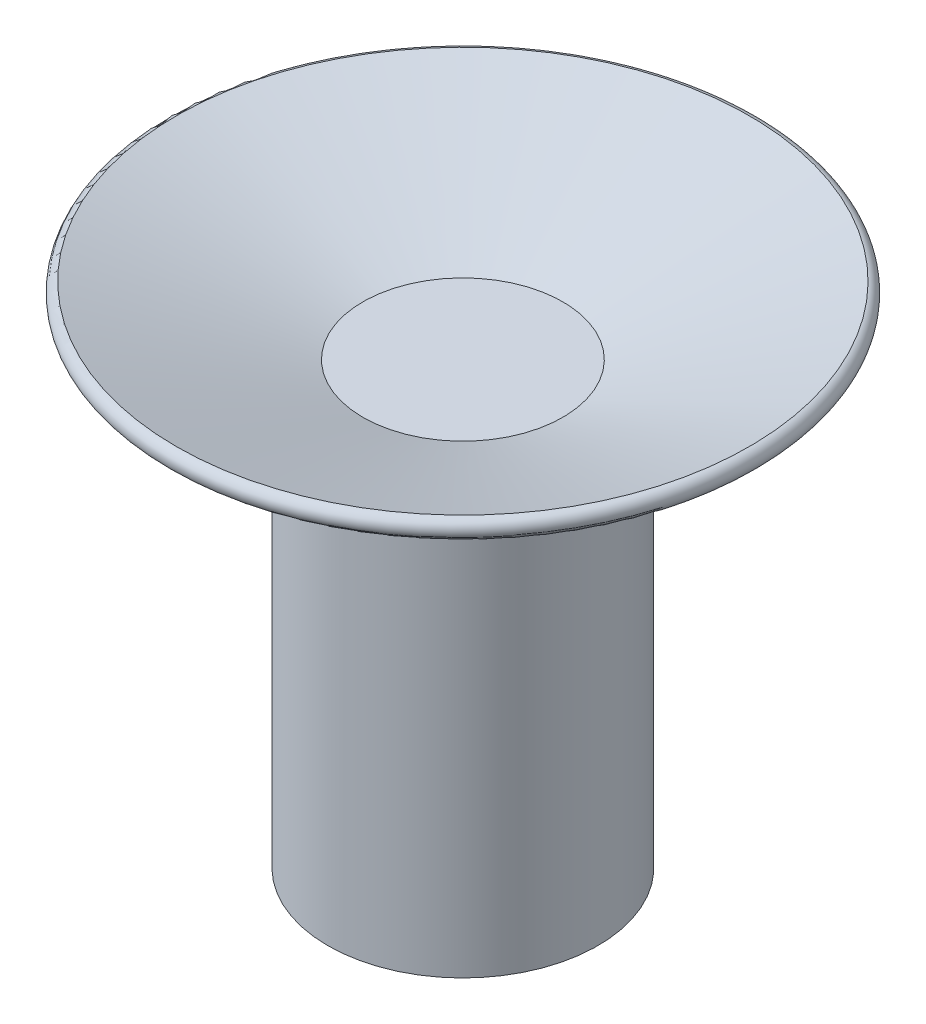
ISO-10303-21;
HEADER;
FILE_DESCRIPTION(('STEP AP214'),'2;1');
FILE_NAME('part.step','',(''),(''),'','','');
FILE_SCHEMA(('AUTOMOTIVE_DESIGN { 1 0 10303 214 1 1 1 1 }'));
ENDSEC;
DATA;
#1=APPLICATION_CONTEXT('core data for automotive mechanical design processes');
#2=APPLICATION_PROTOCOL_DEFINITION('international standard','automotive_design',2000,#1);
#3=PRODUCT_CONTEXT('',#1,'mechanical');
#4=PRODUCT('Part','Part','',(#3));
#5=PRODUCT_RELATED_PRODUCT_CATEGORY('part','',(#4));
#6=PRODUCT_DEFINITION_FORMATION('','',#4);
#7=PRODUCT_DEFINITION_CONTEXT('part definition',#1,'design');
#8=PRODUCT_DEFINITION('design','',#6,#7);
#9=PRODUCT_DEFINITION_SHAPE('','',#8);
#10=(LENGTH_UNIT() NAMED_UNIT(*) SI_UNIT(.MILLI.,.METRE.));
#11=(NAMED_UNIT(*) PLANE_ANGLE_UNIT() SI_UNIT($,.RADIAN.));
#12=(NAMED_UNIT(*) SI_UNIT($,.STERADIAN.) SOLID_ANGLE_UNIT());
#13=UNCERTAINTY_MEASURE_WITH_UNIT(LENGTH_MEASURE(1.E-05),#10,'distance_accuracy_value','');
#14=(GEOMETRIC_REPRESENTATION_CONTEXT(3) GLOBAL_UNCERTAINTY_ASSIGNED_CONTEXT((#13)) GLOBAL_UNIT_ASSIGNED_CONTEXT((#10,
#11,#12)) REPRESENTATION_CONTEXT('',''));
#15=CARTESIAN_POINT('',(0.,0.,0.));
#16=DIRECTION('',(0.,0.,1.));
#17=DIRECTION('',(1.,0.,0.));
#18=AXIS2_PLACEMENT_3D('',#15,#16,#17);
#19=CARTESIAN_POINT('',(0.,0.,0.));
#20=DIRECTION('',(0.,-1.,0.));
#21=DIRECTION('',(0.,0.,1.));
#22=AXIS2_PLACEMENT_3D('',#19,#20,#21);
#23=PLANE('',#22);
#24=DIRECTION('',(0.997623228537443,0.,-0.0689049626843327));
#25=VECTOR('',#24,1.);
#26=CARTESIAN_POINT('',(-2.19569083068635,0.,4.4920977033052));
#27=LINE('',#26,#25);
#28=CARTESIAN_POINT('',(-2.19569083068635,0.,4.49209770330521));
#29=VERTEX_POINT('',#28);
#30=CARTESIAN_POINT('',(2.79242531200086,0.,4.14757288988354));
#31=VERTEX_POINT('',#30);
#32=EDGE_CURVE('E107',#29,#31,#27,.T.);
#33=ORIENTED_EDGE('',*,*,#32,.T.);
#34=CARTESIAN_POINT('',(0.,0.,0.));
#35=DIRECTION('',(0.,1.,0.));
#36=DIRECTION('',(0.,0.,1.));
#37=AXIS2_PLACEMENT_3D('',#34,#35,#36);
#38=CIRCLE('',#37,5.);
#39=EDGE_CURVE('E44',#29,#31,#38,.T.);
#40=ORIENTED_EDGE('',*,*,#39,.F.);
#41=EDGE_LOOP('',(#33,#40));
#42=FACE_BOUND('',#41,.T.);
#43=ADVANCED_FACE('F35',(#42),#23,.T.);
#44=DIRECTION('',(0.558485062400172,0.,0.829514577976708));
#45=VECTOR('',#44,1.);
#46=CARTESIAN_POINT('',(-4.98811614268721,0.,0.344524813421662));
#47=LINE('',#46,#45);
#48=CARTESIAN_POINT('',(-4.98811614268721,0.,0.344524813421667));
#49=VERTEX_POINT('',#48);
#50=EDGE_CURVE('E102',#49,#29,#47,.T.);
#51=ORIENTED_EDGE('',*,*,#50,.T.);
#52=EDGE_CURVE('E131',#49,#29,#38,.T.);
#53=ORIENTED_EDGE('',*,*,#52,.F.);
#54=EDGE_LOOP('',(#51,#53));
#55=FACE_BOUND('',#54,.T.);
#56=ADVANCED_FACE('F197',(#55),#23,.T.);
#57=DIRECTION('',(-0.439138166137271,0.,0.898419540661041));
#58=VECTOR('',#57,1.);
#59=CARTESIAN_POINT('',(-2.79242531200086,0.,-4.14757288988354));
#60=LINE('',#59,#58);
#61=CARTESIAN_POINT('',(-2.79242531200086,0.,-4.14757288988354));
#62=VERTEX_POINT('',#61);
#63=EDGE_CURVE('E167',#62,#49,#60,.T.);
#64=ORIENTED_EDGE('',*,*,#63,.T.);
#65=EDGE_CURVE('E134',#62,#49,#38,.T.);
#66=ORIENTED_EDGE('',*,*,#65,.F.);
#67=EDGE_LOOP('',(#64,#66));
#68=FACE_BOUND('',#67,.T.);
#69=ADVANCED_FACE('F202',(#68),#23,.T.);
#70=DIRECTION('',(-0.997623228537443,0.,0.0689049626843323));
#71=VECTOR('',#70,1.);
#72=CARTESIAN_POINT('',(2.19569083068635,0.,-4.4920977033052));
#73=LINE('',#72,#71);
#74=CARTESIAN_POINT('',(2.19569083068634,0.,-4.49209770330521));
#75=VERTEX_POINT('',#74);
#76=EDGE_CURVE('E155',#75,#62,#73,.T.);
#77=ORIENTED_EDGE('',*,*,#76,.T.);
#78=EDGE_CURVE('E137',#75,#62,#38,.T.);
#79=ORIENTED_EDGE('',*,*,#78,.F.);
#80=EDGE_LOOP('',(#77,#79));
#81=FACE_BOUND('',#80,.T.);
#82=ADVANCED_FACE('F160',(#81),#23,.T.);
#83=DIRECTION('',(-0.558485062400172,0.,-0.829514577976708));
#84=VECTOR('',#83,1.);
#85=CARTESIAN_POINT('',(4.98811614268721,0.,-0.344524813421662));
#86=LINE('',#85,#84);
#87=CARTESIAN_POINT('',(4.98811614268721,0.,-0.344524813421662));
#88=VERTEX_POINT('',#87);
#89=EDGE_CURVE('E151',#88,#75,#86,.T.);
#90=ORIENTED_EDGE('',*,*,#89,.T.);
#91=EDGE_CURVE('E43',#88,#75,#38,.T.);
#92=ORIENTED_EDGE('',*,*,#91,.F.);
#93=EDGE_LOOP('',(#90,#92));
#94=FACE_BOUND('',#93,.T.);
#95=ADVANCED_FACE('F152',(#94),#23,.T.);
#96=DIRECTION('',(0.43913816613727,0.,-0.898419540661041));
#97=VECTOR('',#96,1.);
#98=CARTESIAN_POINT('',(2.79242531200086,0.,4.14757288988354));
#99=LINE('',#98,#97);
#100=EDGE_CURVE('E156',#31,#88,#99,.T.);
#101=ORIENTED_EDGE('',*,*,#100,.T.);
#102=EDGE_CURVE('E11',#31,#88,#38,.T.);
#103=ORIENTED_EDGE('',*,*,#102,.F.);
#104=EDGE_LOOP('',(#101,#103));
#105=FACE_BOUND('',#104,.T.);
#106=ADVANCED_FACE('F37',(#105),#23,.T.);
#107=CARTESIAN_POINT('',(0.,0.,0.));
#108=DIRECTION('',(0.,1.,0.));
#109=DIRECTION('',(0.,0.,-1.));
#110=AXIS2_PLACEMENT_3D('',#107,#108,#109);
#111=CONICAL_SURFACE('',#110,5.,1.22173047639603);
#112=CARTESIAN_POINT('',(0.,3.4202014332567,0.));
#113=DIRECTION('',(0.,1.,0.));
#114=DIRECTION('',(0.,0.,1.));
#115=AXIS2_PLACEMENT_3D('',#112,#113,#114);
#116=CIRCLE('',#115,14.3969262078591);
#117=CARTESIAN_POINT('',(0.,3.4202014332567,14.3969262078591));
#118=VERTEX_POINT('',#117);
#119=EDGE_CURVE('E126',#118,#118,#116,.T.);
#120=ORIENTED_EDGE('',*,*,#119,.F.);
#121=EDGE_LOOP('',(#120));
#122=FACE_BOUND('',#121,.T.);
#123=ORIENTED_EDGE('',*,*,#102,.T.);
#124=ORIENTED_EDGE('',*,*,#91,.T.);
#125=ORIENTED_EDGE('',*,*,#78,.T.);
#126=ORIENTED_EDGE('',*,*,#65,.T.);
#127=ORIENTED_EDGE('',*,*,#52,.T.);
#128=ORIENTED_EDGE('',*,*,#39,.T.);
#129=EDGE_LOOP('',(#123,#124,#125,#126,#127,#128));
#130=FACE_BOUND('',#129,.T.);
#131=ADVANCED_FACE('F146',(#122,#130),#111,.T.);
#132=CARTESIAN_POINT('',(0.,3.89627362878787,0.));
#133=DIRECTION('',(0.,-1.,0.));
#134=DIRECTION('',(0.,0.,1.));
#135=AXIS2_PLACEMENT_3D('',#132,#133,#134);
#136=TOROIDAL_SURFACE('',#135,14.223650099324,0.506625448578077);
#137=CARTESIAN_POINT('',(0.,4.39314449683534,0.));
#138=DIRECTION('',(0.,1.,0.));
#139=DIRECTION('',(0.,0.,1.));
#140=AXIS2_PLACEMENT_3D('',#137,#138,#139);
#141=CIRCLE('',#140,14.3225878860017);
#142=CARTESIAN_POINT('',(0.,4.39314449683534,14.3225878860017));
#143=VERTEX_POINT('',#142);
#144=EDGE_CURVE('E124',#143,#143,#141,.T.);
#145=ORIENTED_EDGE('',*,*,#144,.F.);
#146=EDGE_LOOP('',(#145));
#147=FACE_BOUND('',#146,.T.);
#148=ORIENTED_EDGE('',*,*,#119,.T.);
#149=EDGE_LOOP('',(#148));
#150=FACE_BOUND('',#149,.T.);
#151=ADVANCED_FACE('F210',(#147,#150),#136,.T.);
#152=CARTESIAN_POINT('',(0.,4.39314449683534,0.));
#153=DIRECTION('',(0.,1.,0.));
#154=DIRECTION('',(0.,0.,-1.));
#155=AXIS2_PLACEMENT_3D('',#152,#153,#154);
#156=CONICAL_SURFACE('',#155,14.3225878860017,1.22173047639603);
#157=CARTESIAN_POINT('',(0.,1.,0.));
#158=DIRECTION('',(0.,1.,0.));
#159=DIRECTION('',(0.,0.,1.));
#160=AXIS2_PLACEMENT_3D('',#157,#158,#159);
#161=CIRCLE('',#160,5.);
#162=CARTESIAN_POINT('',(0.,1.,5.));
#163=VERTEX_POINT('',#162);
#164=EDGE_CURVE('E121',#163,#163,#161,.T.);
#165=ORIENTED_EDGE('',*,*,#164,.F.);
#166=EDGE_LOOP('',(#165));
#167=FACE_BOUND('',#166,.T.);
#168=ORIENTED_EDGE('',*,*,#144,.T.);
#169=EDGE_LOOP('',(#168));
#170=FACE_BOUND('',#169,.T.);
#171=ADVANCED_FACE('F247',(#167,#170),#156,.F.);
#172=CARTESIAN_POINT('',(5.,1.,0.));
#173=DIRECTION('',(0.,1.,0.));
#174=DIRECTION('',(0.,0.,-1.));
#175=AXIS2_PLACEMENT_3D('',#172,#173,#174);
#176=PLANE('',#175);
#177=ORIENTED_EDGE('',*,*,#164,.T.);
#178=EDGE_LOOP('',(#177));
#179=FACE_BOUND('',#178,.T.);
#180=ADVANCED_FACE('F257',(#179),#176,.T.);
#181=CARTESIAN_POINT('',(-2.19569083068635,-1.,4.4920977033052));
#182=DIRECTION('',(-0.0689049626843327,0.,-0.997623228537443));
#183=DIRECTION('',(0.997623228537443,0.,-0.0689049626843327));
#184=AXIS2_PLACEMENT_3D('',#181,#182,#183);
#185=PLANE('',#184);
#186=ORIENTED_EDGE('',*,*,#32,.F.);
#187=DIRECTION('',(0.,1.,0.));
#188=VECTOR('',#187,1.);
#189=CARTESIAN_POINT('',(-2.19569083068635,-1.,4.4920977033052));
#190=LINE('',#189,#188);
#191=CARTESIAN_POINT('',(-2.19569083068635,-1.,4.4920977033052));
#192=VERTEX_POINT('',#191);
#193=EDGE_CURVE('E51',#192,#29,#190,.T.);
#194=ORIENTED_EDGE('',*,*,#193,.F.);
#195=DIRECTION('',(0.997623228537443,0.,-0.0689049626843327));
#196=VECTOR('',#195,1.);
#197=CARTESIAN_POINT('',(-2.19569083068635,-1.,4.4920977033052));
#198=LINE('',#197,#196);
#199=CARTESIAN_POINT('',(2.79242531200086,-1.,4.14757288988354));
#200=VERTEX_POINT('',#199);
#201=EDGE_CURVE('E96',#192,#200,#198,.T.);
#202=ORIENTED_EDGE('',*,*,#201,.T.);
#203=DIRECTION('',(0.,1.,0.));
#204=VECTOR('',#203,1.);
#205=CARTESIAN_POINT('',(2.79242531200086,-1.,4.14757288988354));
#206=LINE('',#205,#204);
#207=EDGE_CURVE('E119',#200,#31,#206,.T.);
#208=ORIENTED_EDGE('',*,*,#207,.T.);
#209=EDGE_LOOP('',(#186,#194,#202,#208));
#210=FACE_BOUND('',#209,.T.);
#211=ADVANCED_FACE('F105',(#210),#185,.F.);
#212=CARTESIAN_POINT('',(2.79242531200086,-1.,4.14757288988354));
#213=DIRECTION('',(-0.898419540661041,0.,-0.43913816613727));
#214=DIRECTION('',(0.43913816613727,0.,-0.898419540661041));
#215=AXIS2_PLACEMENT_3D('',#212,#213,#214);
#216=PLANE('',#215);
#217=ORIENTED_EDGE('',*,*,#100,.F.);
#218=ORIENTED_EDGE('',*,*,#207,.F.);
#219=DIRECTION('',(0.43913816613727,0.,-0.898419540661041));
#220=VECTOR('',#219,1.);
#221=CARTESIAN_POINT('',(2.79242531200086,-1.,4.14757288988354));
#222=LINE('',#221,#220);
#223=CARTESIAN_POINT('',(4.98811614268721,-1.,-0.344524813421662));
#224=VERTEX_POINT('',#223);
#225=EDGE_CURVE('E99',#200,#224,#222,.T.);
#226=ORIENTED_EDGE('',*,*,#225,.T.);
#227=DIRECTION('',(0.,1.,0.));
#228=VECTOR('',#227,1.);
#229=CARTESIAN_POINT('',(4.98811614268721,-1.,-0.344524813421662));
#230=LINE('',#229,#228);
#231=EDGE_CURVE('E117',#224,#88,#230,.T.);
#232=ORIENTED_EDGE('',*,*,#231,.T.);
#233=EDGE_LOOP('',(#217,#218,#226,#232));
#234=FACE_BOUND('',#233,.T.);
#235=ADVANCED_FACE('F214',(#234),#216,.F.);
#236=CARTESIAN_POINT('',(4.98811614268721,-1.,-0.344524813421662));
#237=DIRECTION('',(-0.829514577976708,0.,0.558485062400172));
#238=DIRECTION('',(-0.558485062400172,0.,-0.829514577976708));
#239=AXIS2_PLACEMENT_3D('',#236,#237,#238);
#240=PLANE('',#239);
#241=ORIENTED_EDGE('',*,*,#89,.F.);
#242=ORIENTED_EDGE('',*,*,#231,.F.);
#243=DIRECTION('',(-0.558485062400172,0.,-0.829514577976708));
#244=VECTOR('',#243,1.);
#245=CARTESIAN_POINT('',(4.98811614268721,-1.,-0.344524813421662));
#246=LINE('',#245,#244);
#247=CARTESIAN_POINT('',(2.19569083068635,-1.,-4.4920977033052));
#248=VERTEX_POINT('',#247);
#249=EDGE_CURVE('E176',#224,#248,#246,.T.);
#250=ORIENTED_EDGE('',*,*,#249,.T.);
#251=DIRECTION('',(0.,1.,0.));
#252=VECTOR('',#251,1.);
#253=CARTESIAN_POINT('',(2.19569083068635,-1.,-4.4920977033052));
#254=LINE('',#253,#252);
#255=EDGE_CURVE('E115',#248,#75,#254,.T.);
#256=ORIENTED_EDGE('',*,*,#255,.T.);
#257=EDGE_LOOP('',(#241,#242,#250,#256));
#258=FACE_BOUND('',#257,.T.);
#259=ADVANCED_FACE('F215',(#258),#240,.F.);
#260=CARTESIAN_POINT('',(2.19569083068635,-1.,-4.4920977033052));
#261=DIRECTION('',(0.0689049626843323,0.,0.997623228537443));
#262=DIRECTION('',(-0.997623228537443,0.,0.0689049626843323));
#263=AXIS2_PLACEMENT_3D('',#260,#261,#262);
#264=PLANE('',#263);
#265=ORIENTED_EDGE('',*,*,#76,.F.);
#266=ORIENTED_EDGE('',*,*,#255,.F.);
#267=DIRECTION('',(-0.997623228537443,0.,0.0689049626843323));
#268=VECTOR('',#267,1.);
#269=CARTESIAN_POINT('',(2.19569083068635,-1.,-4.4920977033052));
#270=LINE('',#269,#268);
#271=CARTESIAN_POINT('',(-2.79242531200086,-1.,-4.14757288988354));
#272=VERTEX_POINT('',#271);
#273=EDGE_CURVE('E174',#248,#272,#270,.T.);
#274=ORIENTED_EDGE('',*,*,#273,.T.);
#275=DIRECTION('',(0.,1.,0.));
#276=VECTOR('',#275,1.);
#277=CARTESIAN_POINT('',(-2.79242531200086,-1.,-4.14757288988354));
#278=LINE('',#277,#276);
#279=EDGE_CURVE('E109',#272,#62,#278,.T.);
#280=ORIENTED_EDGE('',*,*,#279,.T.);
#281=EDGE_LOOP('',(#265,#266,#274,#280));
#282=FACE_BOUND('',#281,.T.);
#283=ADVANCED_FACE('F163',(#282),#264,.F.);
#284=CARTESIAN_POINT('',(-2.79242531200086,-1.,-4.14757288988354));
#285=DIRECTION('',(0.898419540661041,0.,0.439138166137271));
#286=DIRECTION('',(-0.439138166137271,0.,0.898419540661041));
#287=AXIS2_PLACEMENT_3D('',#284,#285,#286);
#288=PLANE('',#287);
#289=ORIENTED_EDGE('',*,*,#63,.F.);
#290=ORIENTED_EDGE('',*,*,#279,.F.);
#291=DIRECTION('',(-0.439138166137271,0.,0.898419540661041));
#292=VECTOR('',#291,1.);
#293=CARTESIAN_POINT('',(-2.79242531200086,-1.,-4.14757288988354));
#294=LINE('',#293,#292);
#295=CARTESIAN_POINT('',(-4.98811614268721,-1.,0.344524813421662));
#296=VERTEX_POINT('',#295);
#297=EDGE_CURVE('E93',#272,#296,#294,.T.);
#298=ORIENTED_EDGE('',*,*,#297,.T.);
#299=DIRECTION('',(0.,1.,0.));
#300=VECTOR('',#299,1.);
#301=CARTESIAN_POINT('',(-4.98811614268721,-1.,0.344524813421662));
#302=LINE('',#301,#300);
#303=EDGE_CURVE('E59',#296,#49,#302,.T.);
#304=ORIENTED_EDGE('',*,*,#303,.T.);
#305=EDGE_LOOP('',(#289,#290,#298,#304));
#306=FACE_BOUND('',#305,.T.);
#307=ADVANCED_FACE('F216',(#306),#288,.F.);
#308=CARTESIAN_POINT('',(-4.98811614268721,-1.,0.344524813421662));
#309=DIRECTION('',(0.829514577976708,0.,-0.558485062400172));
#310=DIRECTION('',(0.558485062400172,0.,0.829514577976708));
#311=AXIS2_PLACEMENT_3D('',#308,#309,#310);
#312=PLANE('',#311);
#313=ORIENTED_EDGE('',*,*,#50,.F.);
#314=ORIENTED_EDGE('',*,*,#303,.F.);
#315=DIRECTION('',(0.558485062400172,0.,0.829514577976708));
#316=VECTOR('',#315,1.);
#317=CARTESIAN_POINT('',(-4.98811614268721,-1.,0.344524813421662));
#318=LINE('',#317,#316);
#319=EDGE_CURVE('E89',#296,#192,#318,.T.);
#320=ORIENTED_EDGE('',*,*,#319,.T.);
#321=ORIENTED_EDGE('',*,*,#193,.T.);
#322=EDGE_LOOP('',(#313,#314,#320,#321));
#323=FACE_BOUND('',#322,.T.);
#324=ADVANCED_FACE('F91',(#323),#312,.F.);
#325=CARTESIAN_POINT('',(0.,-1.,0.));
#326=DIRECTION('',(0.,-1.,0.));
#327=DIRECTION('',(0.,0.,1.));
#328=AXIS2_PLACEMENT_3D('',#325,#326,#327);
#329=PLANE('',#328);
#330=CARTESIAN_POINT('',(0.,-1.,0.));
#331=DIRECTION('',(0.,1.,0.));
#332=DIRECTION('',(0.,0.,1.));
#333=AXIS2_PLACEMENT_3D('',#330,#331,#332);
#334=CIRCLE('',#333,6.75);
#335=CARTESIAN_POINT('',(0.,-1.,6.75));
#336=VERTEX_POINT('',#335);
#337=EDGE_CURVE('E179',#336,#336,#334,.T.);
#338=ORIENTED_EDGE('',*,*,#337,.T.);
#339=EDGE_LOOP('',(#338));
#340=FACE_BOUND('',#339,.T.);
#341=ORIENTED_EDGE('',*,*,#319,.F.);
#342=ORIENTED_EDGE('',*,*,#297,.F.);
#343=ORIENTED_EDGE('',*,*,#273,.F.);
#344=ORIENTED_EDGE('',*,*,#249,.F.);
#345=ORIENTED_EDGE('',*,*,#225,.F.);
#346=ORIENTED_EDGE('',*,*,#201,.F.);
#347=EDGE_LOOP('',(#341,#342,#343,#344,#345,#346));
#348=FACE_BOUND('',#347,.T.);
#349=ADVANCED_FACE('F97',(#340,#348),#329,.F.);
#350=CARTESIAN_POINT('',(0.,-21.,0.));
#351=DIRECTION('',(0.,1.,0.));
#352=DIRECTION('',(0.,0.,-1.));
#353=AXIS2_PLACEMENT_3D('',#350,#351,#352);
#354=CYLINDRICAL_SURFACE('',#353,6.75);
#355=CARTESIAN_POINT('',(0.,-21.,0.));
#356=DIRECTION('',(0.,1.,0.));
#357=DIRECTION('',(0.,0.,1.));
#358=AXIS2_PLACEMENT_3D('',#355,#356,#357);
#359=CIRCLE('',#358,6.75);
#360=CARTESIAN_POINT('',(0.,-21.,6.75));
#361=VERTEX_POINT('',#360);
#362=EDGE_CURVE('E171',#361,#361,#359,.T.);
#363=ORIENTED_EDGE('',*,*,#362,.T.);
#364=EDGE_LOOP('',(#363));
#365=FACE_BOUND('',#364,.T.);
#366=ORIENTED_EDGE('',*,*,#337,.F.);
#367=EDGE_LOOP('',(#366));
#368=FACE_BOUND('',#367,.T.);
#369=ADVANCED_FACE('F185',(#365,#368),#354,.T.);
#370=CARTESIAN_POINT('',(0.,-21.,0.));
#371=DIRECTION('',(0.,-1.,0.));
#372=DIRECTION('',(0.,0.,1.));
#373=AXIS2_PLACEMENT_3D('',#370,#371,#372);
#374=PLANE('',#373);
#375=ORIENTED_EDGE('',*,*,#362,.F.);
#376=EDGE_LOOP('',(#375));
#377=FACE_BOUND('',#376,.T.);
#378=ADVANCED_FACE('F188',(#377),#374,.T.);
#379=CLOSED_SHELL('',(#43,#56,#69,#82,#95,#106,#131,#151,#171,#180,#211,#235,#259,#283,#307,
#324,#349,#369,#378));
#380=MANIFOLD_SOLID_BREP('B2',#379);
#381=ADVANCED_BREP_SHAPE_REPRESENTATION('',(#18,#380),#14);
#382=SHAPE_DEFINITION_REPRESENTATION(#9,#381);
ENDSEC;
END-ISO-10303-21;
